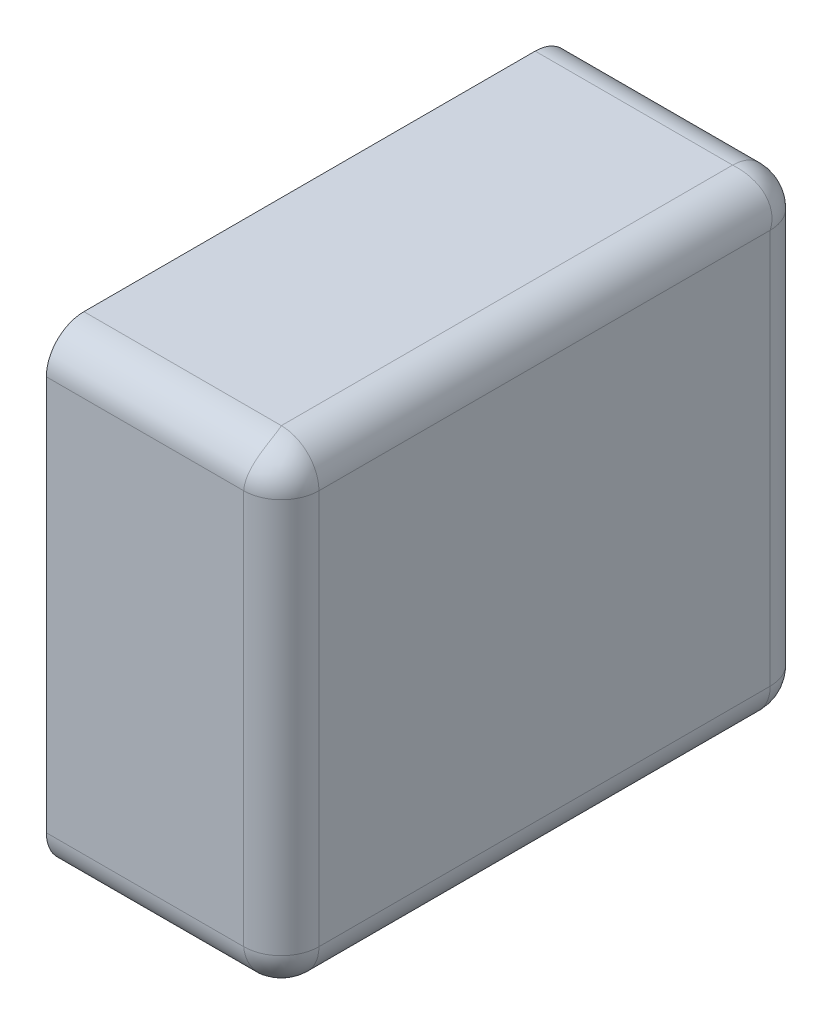
ISO-10303-21;
HEADER;
FILE_DESCRIPTION(('STEP AP214'),'2;1');
FILE_NAME('part.step','',(''),(''),'','','');
FILE_SCHEMA(('AUTOMOTIVE_DESIGN { 1 0 10303 214 1 1 1 1 }'));
ENDSEC;
DATA;
#1=APPLICATION_CONTEXT('core data for automotive mechanical design processes');
#2=APPLICATION_PROTOCOL_DEFINITION('international standard','automotive_design',2000,#1);
#3=PRODUCT_CONTEXT('',#1,'mechanical');
#4=PRODUCT('Part','Part','',(#3));
#5=PRODUCT_RELATED_PRODUCT_CATEGORY('part','',(#4));
#6=PRODUCT_DEFINITION_FORMATION('','',#4);
#7=PRODUCT_DEFINITION_CONTEXT('part definition',#1,'design');
#8=PRODUCT_DEFINITION('design','',#6,#7);
#9=PRODUCT_DEFINITION_SHAPE('','',#8);
#10=(LENGTH_UNIT() NAMED_UNIT(*) SI_UNIT(.MILLI.,.METRE.));
#11=(NAMED_UNIT(*) PLANE_ANGLE_UNIT() SI_UNIT($,.RADIAN.));
#12=(NAMED_UNIT(*) SI_UNIT($,.STERADIAN.) SOLID_ANGLE_UNIT());
#13=UNCERTAINTY_MEASURE_WITH_UNIT(LENGTH_MEASURE(1.E-05),#10,'distance_accuracy_value','');
#14=(GEOMETRIC_REPRESENTATION_CONTEXT(3) GLOBAL_UNCERTAINTY_ASSIGNED_CONTEXT((#13)) GLOBAL_UNIT_ASSIGNED_CONTEXT((#10,
#11,#12)) REPRESENTATION_CONTEXT('',''));
#15=CARTESIAN_POINT('',(0.,0.,0.));
#16=DIRECTION('',(0.,0.,1.));
#17=DIRECTION('',(1.,0.,0.));
#18=AXIS2_PLACEMENT_3D('',#15,#16,#17);
#19=CARTESIAN_POINT('',(0.46,-0.21,0.52));
#20=DIRECTION('',(-0.408248290463862,-0.816496580927726,-0.408248290463864));
#21=DIRECTION('',(0.577350269189625,-0.577350269189626,0.577350269189627));
#22=AXIS2_PLACEMENT_3D('',#19,#20,#21);
#23=SPHERICAL_SURFACE('',#22,0.04);
#24=CARTESIAN_POINT('',(0.46,-0.21,0.56));
#25=CARTESIAN_POINT('',(0.460045181312705,-0.210665081942134,0.560000016251174));
#26=CARTESIAN_POINT('',(0.460096934649245,-0.211329688899863,0.559983337054039));
#27=CARTESIAN_POINT('',(0.460212312956499,-0.212659219399001,0.55991655645203));
#28=CARTESIAN_POINT('',(0.460275990401151,-0.213324130857231,0.559866304694446));
#29=CARTESIAN_POINT('',(0.460413787737315,-0.214652188884861,0.559732078063409));
#30=CARTESIAN_POINT('',(0.460487948826669,-0.215315317435962,0.559647967602046));
#31=CARTESIAN_POINT('',(0.460645216653365,-0.21663777331629,0.559445897918684));
#32=CARTESIAN_POINT('',(0.4607283543202,-0.217297078685777,0.559327819170727));
#33=CARTESIAN_POINT('',(0.46090202300229,-0.218609877799322,0.559057833913879));
#34=CARTESIAN_POINT('',(0.460992575894087,-0.21926334754146,0.558905824846854));
#35=CARTESIAN_POINT('',(0.461179475341301,-0.220562505613394,0.558568156224819));
#36=CARTESIAN_POINT('',(0.461275836098283,-0.221208169816909,0.558382411747495));
#37=CARTESIAN_POINT('',(0.46147271375646,-0.222489792933958,0.557977604210201));
#38=CARTESIAN_POINT('',(0.46157323870074,-0.223125729474544,0.557758474251228));
#39=CARTESIAN_POINT('',(0.46177677883926,-0.22438602682711,0.557287382721173));
#40=CARTESIAN_POINT('',(0.461879797543165,-0.225010368841736,0.557035372388784));
#41=CARTESIAN_POINT('',(0.462086640648683,-0.226245666734241,0.556499161053504));
#42=CARTESIAN_POINT('',(0.462190465730978,-0.226856609134299,0.55621492926737));
#43=CARTESIAN_POINT('',(0.46239722819872,-0.228063363889427,0.555615068285972));
#44=CARTESIAN_POINT('',(0.46250016518995,-0.228659169732883,0.555299425855903));
#45=CARTESIAN_POINT('',(0.462703459130378,-0.229833980057633,0.554637686703484));
#46=CARTESIAN_POINT('',(0.462803816384422,-0.23041298652516,0.554291593601069));
#47=CARTESIAN_POINT('',(0.463000269462519,-0.231552605119571,0.553570042877811));
#48=CARTESIAN_POINT('',(0.463096368054564,-0.232113229130937,0.553194604782275));
#49=CARTESIAN_POINT('',(0.463282643251913,-0.233214573536402,0.552415596564543));
#50=CARTESIAN_POINT('',(0.463372826812942,-0.233755316967508,0.552012060678785));
#51=CARTESIAN_POINT('',(0.46354564201038,-0.234815479598414,0.551178227431671));
#52=CARTESIAN_POINT('',(0.463628286445982,-0.235334934082229,0.550747977592035));
#53=CARTESIAN_POINT('',(0.463784433723584,-0.236351191404029,0.549862219687463));
#54=CARTESIAN_POINT('',(0.463857956766166,-0.236848042695183,0.549406770787941));
#55=CARTESIAN_POINT('',(0.463994321319257,-0.237817863512161,0.548472244674781));
#56=CARTESIAN_POINT('',(0.46405719186342,-0.23829089539864,0.547993236431504));
#57=CARTESIAN_POINT('',(0.464170770435167,-0.239211948220121,0.547013341512198));
#58=CARTESIAN_POINT('',(0.464221517607221,-0.239660045967351,0.546512531597073));
#59=CARTESIAN_POINT('',(0.464309436340763,-0.240530205425421,0.545490895871217));
#60=CARTESIAN_POINT('',(0.464346658254607,-0.240952358740541,0.544970152446474));
#61=CARTESIAN_POINT('',(0.464406189870943,-0.241769711036923,0.543910616989062));
#62=CARTESIAN_POINT('',(0.4644285620246,-0.242165016543171,0.543371910678868));
#63=CARTESIAN_POINT('',(0.464457142234807,-0.242927863908271,0.542278513023084));
#64=CARTESIAN_POINT('',(0.464463425502259,-0.243295527122686,0.541723908356188));
#65=CARTESIAN_POINT('',(0.464458668570609,-0.244002391272381,0.540600864869804));
#66=CARTESIAN_POINT('',(0.464447716751283,-0.244341728079411,0.540032511248382));
#67=CARTESIAN_POINT('',(0.46440743011501,-0.244991352668484,0.538884198547395));
#68=CARTESIAN_POINT('',(0.464378196984959,-0.245301790296003,0.538304320731066));
#69=CARTESIAN_POINT('',(0.464300394897465,-0.245893142340814,0.537135256366021));
#70=CARTESIAN_POINT('',(0.464251940785221,-0.246174219805183,0.53654614471619));
#71=CARTESIAN_POINT('',(0.464134856746394,-0.246706490168637,0.535360966678358));
#72=CARTESIAN_POINT('',(0.464066354376574,-0.246957858314749,0.534764966470295));
#73=CARTESIAN_POINT('',(0.46390845289006,-0.247430460923945,0.533568413630763));
#74=CARTESIAN_POINT('',(0.463819193285901,-0.247651881608702,0.53296791621749));
#75=CARTESIAN_POINT('',(0.463619178639514,-0.248064452661553,0.531764802341561));
#76=CARTESIAN_POINT('',(0.463508574015279,-0.24825579877532,0.531162228110556));
#77=CARTESIAN_POINT('',(0.463265404318733,-0.248608191353398,0.529957437108347));
#78=CARTESIAN_POINT('',(0.463132999169867,-0.248769441456167,0.529355247629956));
#79=CARTESIAN_POINT('',(0.462845874981088,-0.249061732555454,0.528153648342018));
#80=CARTESIAN_POINT('',(0.462691323865077,-0.249192983158802,0.527554249833818));
#81=CARTESIAN_POINT('',(0.462442185895687,-0.249367646988296,0.526657556406001));
#82=CARTESIAN_POINT('',(0.462356511105421,-0.249422048123955,0.526359866083455));
#83=CARTESIAN_POINT('',(0.462179544933358,-0.24952340711272,0.525766109942693));
#84=CARTESIAN_POINT('',(0.462088275552899,-0.249570391814223,0.525470042193562));
#85=CARTESIAN_POINT('',(0.461900119585062,-0.249656954688614,0.524879850156528));
#86=CARTESIAN_POINT('',(0.461803255191422,-0.249696559802491,0.524585722737492));
#87=CARTESIAN_POINT('',(0.461603913603208,-0.249768410388877,0.523999713457951));
#88=CARTESIAN_POINT('',(0.461501458734764,-0.249800682809452,0.523707827313347));
#89=CARTESIAN_POINT('',(0.461290950148552,-0.249857919916979,0.523126605044557));
#90=CARTESIAN_POINT('',(0.461182918810225,-0.249882911490818,0.5228372634657));
#91=CARTESIAN_POINT('',(0.460961279831825,-0.2499256451994,0.522261431714088));
#92=CARTESIAN_POINT('',(0.460847694547059,-0.249943414085128,0.521974934925471));
#93=CARTESIAN_POINT('',(0.460614978217461,-0.249971766016728,0.521405091561275));
#94=CARTESIAN_POINT('',(0.460495869427172,-0.249982375605942,0.521121737223217));
#95=CARTESIAN_POINT('',(0.460252147979106,-0.249996480060414,0.520558476265733));
#96=CARTESIAN_POINT('',(0.460127557385056,-0.250000001180721,0.520278560754346));
#97=CARTESIAN_POINT('',(0.46,-0.25,0.52));
#98=B_SPLINE_CURVE_WITH_KNOTS('',3,(#24,#25,#26,#27,#28,#29,#30,#31,#32,#33,#34,#35,#36,#37,#38,
#39,#40,#41,#42,#43,#44,#45,#46,#47,#48,#49,#50,#51,#52,#53,#54,#55,#56,#57,#58,#59,#60,#61,#62,
#63,#64,#65,#66,#67,#68,#69,#70,#71,#72,#73,#74,#75,#76,#77,#78,#79,#80,#81,#82,#83,#84,#85,#86,
#87,#88,#89,#90,#91,#92,#93,#94,#95,#96,#97),.UNSPECIFIED.,.F.,.F.,(4,2,2,2,2,2,2,2,2,2,2,2,2,2,
2,2,2,2,2,2,2,2,2,2,2,2,2,2,2,2,2,2,2,2,2,2,4),(0.,0.00199956279863084,0.0040081410898894,
0.0060248440879793,0.00804873202897933,0.010078822288103,0.0121140955766896,0.0141535022022144,
0.0161959683770328,0.0182404025635261,0.0202857018448312,0.0223307583114294,0.0243744654545608,
0.0264157245577323,0.0284534510775014,0.0304865810042484,0.0325140771927836,0.0345349356513621,
0.036548191775973,0.0385529265146135,0.0405482724436222,0.0425334197350034,0.0445076219900069,
0.0464702019100226,0.0484205567711027,0.0503581636631714,0.0522825844492586,0.0541934703940113,
0.0560905664044141,0.0570339941541347,0.0579739241186476,0.0589103523629721,0.0598432814165442,
0.0607727203414586,0.0616986847895223,0.0626211970474673,0.0635402860696658),.UNSPECIFIED.);
#99=CARTESIAN_POINT('',(0.46,-0.21,0.56));
#100=VERTEX_POINT('',#99);
#101=CARTESIAN_POINT('',(0.46,-0.25,0.52));
#102=VERTEX_POINT('',#101);
#103=EDGE_CURVE('E11',#100,#102,#98,.T.);
#104=ORIENTED_EDGE('',*,*,#103,.T.);
#105=CARTESIAN_POINT('',(0.46,-0.21,0.52));
#106=DIRECTION('',(0.,0.,1.));
#107=DIRECTION('',(1.,0.,0.));
#108=AXIS2_PLACEMENT_3D('',#105,#106,#107);
#109=CIRCLE('',#108,0.04);
#110=CARTESIAN_POINT('',(0.5,-0.21,0.52));
#111=VERTEX_POINT('',#110);
#112=EDGE_CURVE('E25',#102,#111,#109,.T.);
#113=ORIENTED_EDGE('',*,*,#112,.T.);
#114=CARTESIAN_POINT('',(0.46,-0.21,0.52));
#115=DIRECTION('',(0.,-1.,0.));
#116=DIRECTION('',(0.,0.,1.));
#117=AXIS2_PLACEMENT_3D('',#114,#115,#116);
#118=CIRCLE('',#117,0.04);
#119=EDGE_CURVE('E317',#111,#100,#118,.T.);
#120=ORIENTED_EDGE('',*,*,#119,.T.);
#121=EDGE_LOOP('',(#104,#113,#120));
#122=FACE_BOUND('',#121,.T.);
#123=ADVANCED_FACE('F17',(#122),#23,.T.);
#124=CARTESIAN_POINT('',(0.46,-0.21,0.04));
#125=DIRECTION('',(-0.408248290463863,0.408248290463862,-0.816496580927727));
#126=DIRECTION('',(0.577350269189628,-0.577350269189625,-0.577350269189625));
#127=AXIS2_PLACEMENT_3D('',#124,#125,#126);
#128=SPHERICAL_SURFACE('',#127,0.04);
#129=CARTESIAN_POINT('',(0.46,-0.21,0.04));
#130=DIRECTION('',(0.,0.,-1.));
#131=DIRECTION('',(0.,-1.,0.));
#132=AXIS2_PLACEMENT_3D('',#129,#130,#131);
#133=CIRCLE('',#132,0.04);
#134=CARTESIAN_POINT('',(0.5,-0.21,0.04));
#135=VERTEX_POINT('',#134);
#136=CARTESIAN_POINT('',(0.46,-0.25,0.04));
#137=VERTEX_POINT('',#136);
#138=EDGE_CURVE('E315',#135,#137,#133,.T.);
#139=ORIENTED_EDGE('',*,*,#138,.T.);
#140=CARTESIAN_POINT('',(0.46,-0.25,0.04));
#141=CARTESIAN_POINT('',(0.460045181312705,-0.250000016251174,0.0393349180578663));
#142=CARTESIAN_POINT('',(0.460096934649245,-0.249983337054039,0.0386703111001374));
#143=CARTESIAN_POINT('',(0.460212312956498,-0.24991655645203,0.0373407806009987));
#144=CARTESIAN_POINT('',(0.460275990401151,-0.249866304694446,0.0366758691427694));
#145=CARTESIAN_POINT('',(0.460413787737315,-0.249732078063409,0.0353478111151388));
#146=CARTESIAN_POINT('',(0.460487948826669,-0.249647967602046,0.0346846825640378));
#147=CARTESIAN_POINT('',(0.460645216653365,-0.249445897918684,0.03336222668371));
#148=CARTESIAN_POINT('',(0.4607283543202,-0.249327819170727,0.0327029213142236));
#149=CARTESIAN_POINT('',(0.46090202300229,-0.249057833913879,0.0313901222006782));
#150=CARTESIAN_POINT('',(0.460992575894087,-0.248905824846854,0.0307366524585404));
#151=CARTESIAN_POINT('',(0.461179475341301,-0.248568156224819,0.029437494386606));
#152=CARTESIAN_POINT('',(0.461275836098283,-0.248382411747495,0.0287918301830908));
#153=CARTESIAN_POINT('',(0.46147271375646,-0.247977604210201,0.0275102070660422));
#154=CARTESIAN_POINT('',(0.46157323870074,-0.247758474251228,0.0268742705254564));
#155=CARTESIAN_POINT('',(0.46177677883926,-0.247287382721173,0.0256139731728899));
#156=CARTESIAN_POINT('',(0.461879797543165,-0.247035372388784,0.0249896311582642));
#157=CARTESIAN_POINT('',(0.462086640648683,-0.246499161053504,0.0237543332657589));
#158=CARTESIAN_POINT('',(0.462190465730978,-0.24621492926737,0.0231433908657014));
#159=CARTESIAN_POINT('',(0.462397228198719,-0.245615068285972,0.0219366361105733));
#160=CARTESIAN_POINT('',(0.46250016518995,-0.245299425855903,0.0213408302671167));
#161=CARTESIAN_POINT('',(0.462703459130378,-0.244637686703484,0.020166019942367));
#162=CARTESIAN_POINT('',(0.462803816384422,-0.244291593601069,0.0195870134748399));
#163=CARTESIAN_POINT('',(0.463000269462519,-0.243570042877811,0.0184473948804289));
#164=CARTESIAN_POINT('',(0.463096368054564,-0.243194604782275,0.0178867708690628));
#165=CARTESIAN_POINT('',(0.463282643251913,-0.242415596564543,0.0167854264635976));
#166=CARTESIAN_POINT('',(0.463372826812942,-0.242012060678785,0.0162446830324919));
#167=CARTESIAN_POINT('',(0.46354564201038,-0.241178227431671,0.0151845204015858));
#168=CARTESIAN_POINT('',(0.463628286445982,-0.240747977592035,0.0146650659177713));
#169=CARTESIAN_POINT('',(0.463784433723584,-0.239862219687463,0.013648808595971));
#170=CARTESIAN_POINT('',(0.463857956766166,-0.239406770787941,0.013151957304817));
#171=CARTESIAN_POINT('',(0.463994321319257,-0.238472244674781,0.0121821364878388));
#172=CARTESIAN_POINT('',(0.46405719186342,-0.237993236431504,0.0117091046013598));
#173=CARTESIAN_POINT('',(0.464170770435167,-0.237013341512198,0.010788051779879));
#174=CARTESIAN_POINT('',(0.464221517607221,-0.236512531597073,0.0103399540326488));
#175=CARTESIAN_POINT('',(0.464309436340763,-0.235490895871217,0.00946979457457914));
#176=CARTESIAN_POINT('',(0.464346658254607,-0.234970152446474,0.009047641259459));
#177=CARTESIAN_POINT('',(0.464406189870943,-0.233910616989061,0.00823028896307656));
#178=CARTESIAN_POINT('',(0.4644285620246,-0.233371910678868,0.0078349834568294));
#179=CARTESIAN_POINT('',(0.464457142234807,-0.232278513023084,0.0070721360917289));
#180=CARTESIAN_POINT('',(0.464463425502259,-0.231723908356188,0.00670447287731431));
#181=CARTESIAN_POINT('',(0.464458668570609,-0.230600864869804,0.00599760872761896));
#182=CARTESIAN_POINT('',(0.464447716751283,-0.230032511248382,0.00565827192058937));
#183=CARTESIAN_POINT('',(0.46440743011501,-0.228884198547395,0.0050086473315155));
#184=CARTESIAN_POINT('',(0.464378196984959,-0.228304320731066,0.00469820970399707));
#185=CARTESIAN_POINT('',(0.464300394897465,-0.227135256366021,0.00410685765918635));
#186=CARTESIAN_POINT('',(0.464251940785221,-0.22654614471619,0.00382578019481727));
#187=CARTESIAN_POINT('',(0.464134856746394,-0.225360966678358,0.00329350983136255));
#188=CARTESIAN_POINT('',(0.464066354376574,-0.224764966470295,0.00304214168525152));
#189=CARTESIAN_POINT('',(0.46390845289006,-0.223568413630763,0.0025695390760552));
#190=CARTESIAN_POINT('',(0.463819193285901,-0.22296791621749,0.00234811839129834));
#191=CARTESIAN_POINT('',(0.463619178639514,-0.221764802341561,0.00193554733844656));
#192=CARTESIAN_POINT('',(0.463508574015279,-0.221162228110556,0.00174420122467977));
#193=CARTESIAN_POINT('',(0.463265404318734,-0.219957437108347,0.00139180864660246));
#194=CARTESIAN_POINT('',(0.463132999169867,-0.219355247629956,0.00123055854383292));
#195=CARTESIAN_POINT('',(0.462845874981088,-0.218153648342018,0.000938267444546416));
#196=CARTESIAN_POINT('',(0.462691323865077,-0.217554249833819,0.000807016841198092));
#197=CARTESIAN_POINT('',(0.462442185895688,-0.216657556406001,0.000632353011704253));
#198=CARTESIAN_POINT('',(0.462356511105422,-0.216359866083455,0.000577951876045363));
#199=CARTESIAN_POINT('',(0.462179544933358,-0.215766109942693,0.00047659288727976));
#200=CARTESIAN_POINT('',(0.462088275552899,-0.215470042193562,0.000429608185776681));
#201=CARTESIAN_POINT('',(0.461900119585062,-0.214879850156529,0.000343045311385648));
#202=CARTESIAN_POINT('',(0.461803255191423,-0.214585722737492,0.000303440197509093));
#203=CARTESIAN_POINT('',(0.461603913603209,-0.213999713457951,0.000231589611122885));
#204=CARTESIAN_POINT('',(0.461501458734764,-0.213707827313347,0.00019931719054796));
#205=CARTESIAN_POINT('',(0.461290950148552,-0.213126605044557,0.000142080083021138));
#206=CARTESIAN_POINT('',(0.461182918810225,-0.2128372634657,0.000117088509181835));
#207=CARTESIAN_POINT('',(0.460961279831825,-0.212261431714088,7.43548005994835E-05));
#208=CARTESIAN_POINT('',(0.460847694547059,-0.211974934925471,5.65859148722095E-05));
#209=CARTESIAN_POINT('',(0.460614978217461,-0.211405091561275,2.82339832723494E-05));
#210=CARTESIAN_POINT('',(0.460495869427172,-0.211121737223217,1.76243940577182E-05));
#211=CARTESIAN_POINT('',(0.460252147979106,-0.210558476265733,3.5199395857389E-06));
#212=CARTESIAN_POINT('',(0.460127557385056,-0.210278560754346,-1.18072139678394E-09));
#213=CARTESIAN_POINT('',(0.46,-0.21,0.));
#214=B_SPLINE_CURVE_WITH_KNOTS('',3,(#140,#141,#142,#143,#144,#145,#146,#147,#148,#149,#150,
#151,#152,#153,#154,#155,#156,#157,#158,#159,#160,#161,#162,#163,#164,#165,#166,#167,#168,#169,
#170,#171,#172,#173,#174,#175,#176,#177,#178,#179,#180,#181,#182,#183,#184,#185,#186,#187,#188,
#189,#190,#191,#192,#193,#194,#195,#196,#197,#198,#199,#200,#201,#202,#203,#204,#205,#206,#207,
#208,#209,#210,#211,#212,#213),.UNSPECIFIED.,.F.,.F.,(4,2,2,2,2,2,2,2,2,2,2,2,2,2,2,2,2,2,2,2,2,
2,2,2,2,2,2,2,2,2,2,2,2,2,2,2,4),(0.,0.00199956279863086,0.0040081410898894,0.00602484408797931,
0.00804873202897934,0.0100788222881031,0.0121140955766896,0.0141535022022144,0.0161959683770328,
0.0182404025635261,0.0202857018448312,0.0223307583114294,0.0243744654545608,0.0264157245577324,
0.0284534510775015,0.0304865810042485,0.0325140771927837,0.0345349356513622,0.0365481917759731,
0.0385529265146136,0.0405482724436223,0.0425334197350035,0.044507621990007,0.0464702019100227,
0.0484205567711029,0.0503581636631715,0.0522825844492588,0.0541934703940115,0.0560905664044142,
0.0570339941541349,0.0579739241186477,0.0589103523629722,0.0598432814165443,0.0607727203414588,
0.0616986847895225,0.0626211970474674,0.063540286069666),.UNSPECIFIED.);
#215=CARTESIAN_POINT('',(0.46,-0.21,0.));
#216=VERTEX_POINT('',#215);
#217=EDGE_CURVE('E284',#137,#216,#214,.T.);
#218=ORIENTED_EDGE('',*,*,#217,.T.);
#219=CARTESIAN_POINT('',(0.46,-0.21,0.04));
#220=DIRECTION('',(0.,-1.,0.));
#221=DIRECTION('',(1.,0.,0.));
#222=AXIS2_PLACEMENT_3D('',#219,#220,#221);
#223=CIRCLE('',#222,0.04);
#224=EDGE_CURVE('E279',#216,#135,#223,.T.);
#225=ORIENTED_EDGE('',*,*,#224,.T.);
#226=EDGE_LOOP('',(#139,#218,#225));
#227=FACE_BOUND('',#226,.T.);
#228=ADVANCED_FACE('F298',(#227),#128,.T.);
#229=CARTESIAN_POINT('',(0.3125,-0.21,0.04));
#230=DIRECTION('',(1.,0.,0.));
#231=DIRECTION('',(0.,-0.707106781186548,-0.707106781186547));
#232=AXIS2_PLACEMENT_3D('',#229,#230,#231);
#233=CYLINDRICAL_SURFACE('',#232,0.04);
#234=CARTESIAN_POINT('',(0.250000000000001,-0.21,0.04));
#235=DIRECTION('',(1.,0.,0.));
#236=DIRECTION('',(0.,-0.707106781186548,-0.707106781186547));
#237=AXIS2_PLACEMENT_3D('',#234,#235,#236);
#238=CIRCLE('',#237,0.04);
#239=CARTESIAN_POINT('',(0.25,-0.25,0.04));
#240=VERTEX_POINT('',#239);
#241=CARTESIAN_POINT('',(0.25,-0.21,0.));
#242=VERTEX_POINT('',#241);
#243=EDGE_CURVE('E277',#240,#242,#238,.T.);
#244=ORIENTED_EDGE('',*,*,#243,.T.);
#245=DIRECTION('',(1.,0.,0.));
#246=VECTOR('',#245,1.);
#247=CARTESIAN_POINT('',(0.3125,-0.21,0.));
#248=LINE('',#247,#246);
#249=EDGE_CURVE('E272',#242,#216,#248,.T.);
#250=ORIENTED_EDGE('',*,*,#249,.T.);
#251=ORIENTED_EDGE('',*,*,#217,.F.);
#252=DIRECTION('',(-1.,0.,0.));
#253=VECTOR('',#252,1.);
#254=CARTESIAN_POINT('',(0.3125,-0.25,0.04));
#255=LINE('',#254,#253);
#256=EDGE_CURVE('E267',#137,#240,#255,.T.);
#257=ORIENTED_EDGE('',*,*,#256,.T.);
#258=EDGE_LOOP('',(#244,#250,#251,#257));
#259=FACE_BOUND('',#258,.T.);
#260=ADVANCED_FACE('F290',(#259),#233,.T.);
#261=CARTESIAN_POINT('',(0.46,0.21,0.52));
#262=DIRECTION('',(0.408248290463863,-0.816496580927726,0.408248290463864));
#263=DIRECTION('',(0.577350269189626,0.577350269189626,0.577350269189625));
#264=AXIS2_PLACEMENT_3D('',#261,#262,#263);
#265=SPHERICAL_SURFACE('',#264,0.04);
#266=CARTESIAN_POINT('',(0.46,0.21,0.52));
#267=DIRECTION('',(0.,1.,0.));
#268=DIRECTION('',(1.,0.,0.));
#269=AXIS2_PLACEMENT_3D('',#266,#267,#268);
#270=CIRCLE('',#269,0.04);
#271=CARTESIAN_POINT('',(0.46,0.21,0.56));
#272=VERTEX_POINT('',#271);
#273=CARTESIAN_POINT('',(0.5,0.21,0.52));
#274=VERTEX_POINT('',#273);
#275=EDGE_CURVE('E263',#272,#274,#270,.T.);
#276=ORIENTED_EDGE('',*,*,#275,.T.);
#277=CARTESIAN_POINT('',(0.46,0.21,0.52));
#278=DIRECTION('',(0.,0.,1.));
#279=DIRECTION('',(0.,1.,0.));
#280=AXIS2_PLACEMENT_3D('',#277,#278,#279);
#281=CIRCLE('',#280,0.04);
#282=CARTESIAN_POINT('',(0.46,0.25,0.52));
#283=VERTEX_POINT('',#282);
#284=EDGE_CURVE('E261',#274,#283,#281,.T.);
#285=ORIENTED_EDGE('',*,*,#284,.T.);
#286=CARTESIAN_POINT('',(0.46,0.25,0.52));
#287=CARTESIAN_POINT('',(0.460127557385056,0.250000001180721,0.520278560754346));
#288=CARTESIAN_POINT('',(0.460252147979106,0.249996480060414,0.520558476265733));
#289=CARTESIAN_POINT('',(0.460495869427172,0.249982375605942,0.521121737223217));
#290=CARTESIAN_POINT('',(0.460614978217461,0.249971766016728,0.521405091561275));
#291=CARTESIAN_POINT('',(0.460847694547059,0.249943414085128,0.521974934925471));
#292=CARTESIAN_POINT('',(0.460961279831825,0.249925645199401,0.522261431714088));
#293=CARTESIAN_POINT('',(0.461182918810225,0.249882911490818,0.5228372634657));
#294=CARTESIAN_POINT('',(0.461290950148552,0.249857919916979,0.523126605044557));
#295=CARTESIAN_POINT('',(0.461501458734764,0.249800682809452,0.523707827313347));
#296=CARTESIAN_POINT('',(0.461603913603208,0.249768410388877,0.523999713457951));
#297=CARTESIAN_POINT('',(0.461803255191422,0.249696559802491,0.524585722737492));
#298=CARTESIAN_POINT('',(0.461900119585062,0.249656954688614,0.524879850156528));
#299=CARTESIAN_POINT('',(0.462088275552899,0.249570391814223,0.525470042193562));
#300=CARTESIAN_POINT('',(0.462179544933358,0.24952340711272,0.525766109942693));
#301=CARTESIAN_POINT('',(0.462356511105421,0.249422048123955,0.526359866083455));
#302=CARTESIAN_POINT('',(0.462442185895687,0.249367646988296,0.526657556406001));
#303=CARTESIAN_POINT('',(0.462691323865077,0.249192983158802,0.527554249833818));
#304=CARTESIAN_POINT('',(0.462845874981088,0.249061732555454,0.528153648342018));
#305=CARTESIAN_POINT('',(0.463132999169867,0.248769441456167,0.529355247629956));
#306=CARTESIAN_POINT('',(0.463265404318734,0.248608191353398,0.529957437108347));
#307=CARTESIAN_POINT('',(0.463508574015279,0.24825579877532,0.531162228110556));
#308=CARTESIAN_POINT('',(0.463619178639514,0.248064452661553,0.531764802341561));
#309=CARTESIAN_POINT('',(0.463819193285901,0.247651881608702,0.53296791621749));
#310=CARTESIAN_POINT('',(0.46390845289006,0.247430460923945,0.533568413630763));
#311=CARTESIAN_POINT('',(0.464066354376574,0.246957858314749,0.534764966470295));
#312=CARTESIAN_POINT('',(0.464134856746394,0.246706490168638,0.535360966678358));
#313=CARTESIAN_POINT('',(0.464251940785221,0.246174219805183,0.53654614471619));
#314=CARTESIAN_POINT('',(0.464300394897465,0.245893142340814,0.537135256366021));
#315=CARTESIAN_POINT('',(0.464378196984959,0.245301790296003,0.538304320731066));
#316=CARTESIAN_POINT('',(0.46440743011501,0.244991352668485,0.538884198547395));
#317=CARTESIAN_POINT('',(0.464447716751283,0.244341728079411,0.540032511248382));
#318=CARTESIAN_POINT('',(0.464458668570609,0.244002391272381,0.540600864869804));
#319=CARTESIAN_POINT('',(0.464463425502259,0.243295527122686,0.541723908356188));
#320=CARTESIAN_POINT('',(0.464457142234807,0.242927863908271,0.542278513023084));
#321=CARTESIAN_POINT('',(0.4644285620246,0.242165016543171,0.543371910678868));
#322=CARTESIAN_POINT('',(0.464406189870943,0.241769711036923,0.543910616989062));
#323=CARTESIAN_POINT('',(0.464346658254607,0.240952358740541,0.544970152446474));
#324=CARTESIAN_POINT('',(0.464309436340763,0.240530205425421,0.545490895871217));
#325=CARTESIAN_POINT('',(0.464221517607221,0.239660045967351,0.546512531597073));
#326=CARTESIAN_POINT('',(0.464170770435167,0.239211948220121,0.547013341512198));
#327=CARTESIAN_POINT('',(0.46405719186342,0.23829089539864,0.547993236431504));
#328=CARTESIAN_POINT('',(0.463994321319257,0.237817863512161,0.548472244674781));
#329=CARTESIAN_POINT('',(0.463857956766166,0.236848042695183,0.549406770787941));
#330=CARTESIAN_POINT('',(0.463784433723584,0.236351191404029,0.549862219687463));
#331=CARTESIAN_POINT('',(0.463628286445982,0.235334934082229,0.550747977592035));
#332=CARTESIAN_POINT('',(0.46354564201038,0.234815479598414,0.551178227431671));
#333=CARTESIAN_POINT('',(0.463372826812942,0.233755316967508,0.552012060678785));
#334=CARTESIAN_POINT('',(0.463282643251913,0.233214573536402,0.552415596564544));
#335=CARTESIAN_POINT('',(0.463096368054564,0.232113229130937,0.553194604782275));
#336=CARTESIAN_POINT('',(0.463000269462519,0.231552605119571,0.553570042877811));
#337=CARTESIAN_POINT('',(0.462803816384422,0.23041298652516,0.554291593601069));
#338=CARTESIAN_POINT('',(0.462703459130377,0.229833980057633,0.554637686703484));
#339=CARTESIAN_POINT('',(0.46250016518995,0.228659169732883,0.555299425855903));
#340=CARTESIAN_POINT('',(0.462397228198719,0.228063363889427,0.555615068285972));
#341=CARTESIAN_POINT('',(0.462190465730978,0.226856609134299,0.55621492926737));
#342=CARTESIAN_POINT('',(0.462086640648683,0.226245666734241,0.556499161053504));
#343=CARTESIAN_POINT('',(0.461879797543165,0.225010368841736,0.557035372388784));
#344=CARTESIAN_POINT('',(0.46177677883926,0.22438602682711,0.557287382721173));
#345=CARTESIAN_POINT('',(0.46157323870074,0.223125729474544,0.557758474251228));
#346=CARTESIAN_POINT('',(0.46147271375646,0.222489792933958,0.557977604210201));
#347=CARTESIAN_POINT('',(0.461275836098283,0.221208169816909,0.558382411747495));
#348=CARTESIAN_POINT('',(0.461179475341301,0.220562505613394,0.558568156224819));
#349=CARTESIAN_POINT('',(0.460992575894087,0.21926334754146,0.558905824846854));
#350=CARTESIAN_POINT('',(0.46090202300229,0.218609877799322,0.559057833913879));
#351=CARTESIAN_POINT('',(0.4607283543202,0.217297078685776,0.559327819170727));
#352=CARTESIAN_POINT('',(0.460645216653365,0.21663777331629,0.559445897918684));
#353=CARTESIAN_POINT('',(0.460487948826669,0.215315317435962,0.559647967602046));
#354=CARTESIAN_POINT('',(0.460413787737315,0.214652188884861,0.559732078063409));
#355=CARTESIAN_POINT('',(0.460275990401151,0.213324130857231,0.559866304694446));
#356=CARTESIAN_POINT('',(0.460212312956498,0.212659219399001,0.55991655645203));
#357=CARTESIAN_POINT('',(0.460096934649245,0.211329688899863,0.559983337054039));
#358=CARTESIAN_POINT('',(0.460045181312705,0.210665081942134,0.560000016251174));
#359=CARTESIAN_POINT('',(0.46,0.21,0.56));
#360=B_SPLINE_CURVE_WITH_KNOTS('',3,(#286,#287,#288,#289,#290,#291,#292,#293,#294,#295,#296,
#297,#298,#299,#300,#301,#302,#303,#304,#305,#306,#307,#308,#309,#310,#311,#312,#313,#314,#315,
#316,#317,#318,#319,#320,#321,#322,#323,#324,#325,#326,#327,#328,#329,#330,#331,#332,#333,#334,
#335,#336,#337,#338,#339,#340,#341,#342,#343,#344,#345,#346,#347,#348,#349,#350,#351,#352,#353,
#354,#355,#356,#357,#358,#359),.UNSPECIFIED.,.F.,.F.,(4,2,2,2,2,2,2,2,2,2,2,2,2,2,2,2,2,2,2,2,2,
2,2,2,2,2,2,2,2,2,2,2,2,2,2,2,4),(0.,0.0009190890221986,0.00184160128014347,0.00276756572820719,
0.00369700465312164,0.00462993370669375,0.00556636195101832,0.00650629191553119,
0.00744971966525185,0.0093468156756546,0.0112577016204073,0.0131821224064946,0.0151197292985631,
0.0170700841596432,0.0190326640796589,0.0210068663346626,0.0229920136260437,0.0249873595550524,
0.0269920942936929,0.0290053504183038,0.0310262088768824,0.0330537050654176,0.0350868349921645,
0.0371245615119337,0.0391658206151053,0.0412095277582366,0.0432545842248347,0.0452998835061399,
0.0473443176926332,0.0493867838674517,0.0514261904929764,0.053461463781563,0.0554915540406867,
0.0575154419816867,0.0595321449797766,0.0615407232710351,0.063540286069666),.UNSPECIFIED.);
#361=EDGE_CURVE('E248',#283,#272,#360,.T.);
#362=ORIENTED_EDGE('',*,*,#361,.T.);
#363=EDGE_LOOP('',(#276,#285,#362));
#364=FACE_BOUND('',#363,.T.);
#365=ADVANCED_FACE('F222',(#364),#265,.T.);
#366=CARTESIAN_POINT('',(0.46,0.21,0.04));
#367=DIRECTION('',(-0.816496580927726,0.408248290463863,-0.408248290463863));
#368=DIRECTION('',(0.577350269189626,0.577350269189626,-0.577350269189626));
#369=AXIS2_PLACEMENT_3D('',#366,#367,#368);
#370=SPHERICAL_SURFACE('',#369,0.04);
#371=CARTESIAN_POINT('',(0.46,0.25,0.04));
#372=CARTESIAN_POINT('',(0.460665081942134,0.250000016251174,0.0399548186872946));
#373=CARTESIAN_POINT('',(0.461329688899863,0.249983337054039,0.0399030653507546));
#374=CARTESIAN_POINT('',(0.462659219399001,0.24991655645203,0.0397876870435016));
#375=CARTESIAN_POINT('',(0.463324130857231,0.249866304694446,0.0397240095988487));
#376=CARTESIAN_POINT('',(0.464652188884861,0.249732078063409,0.0395862122626852));
#377=CARTESIAN_POINT('',(0.465315317435962,0.249647967602046,0.0395120511733313));
#378=CARTESIAN_POINT('',(0.46663777331629,0.249445897918684,0.0393547833466349));
#379=CARTESIAN_POINT('',(0.467297078685776,0.249327819170727,0.0392716456797998));
#380=CARTESIAN_POINT('',(0.468609877799322,0.249057833913879,0.0390979769977104));
#381=CARTESIAN_POINT('',(0.46926334754146,0.248905824846854,0.039007424105913));
#382=CARTESIAN_POINT('',(0.470562505613394,0.248568156224819,0.0388205246586993));
#383=CARTESIAN_POINT('',(0.471208169816909,0.248382411747495,0.0387241639017174));
#384=CARTESIAN_POINT('',(0.472489792933958,0.247977604210201,0.0385272862435396));
#385=CARTESIAN_POINT('',(0.473125729474544,0.247758474251228,0.0384267612992598));
#386=CARTESIAN_POINT('',(0.47438602682711,0.247287382721173,0.0382232211607403));
#387=CARTESIAN_POINT('',(0.475010368841736,0.247035372388784,0.0381202024568352));
#388=CARTESIAN_POINT('',(0.476245666734241,0.246499161053504,0.0379133593513173));
#389=CARTESIAN_POINT('',(0.476856609134299,0.24621492926737,0.037809534269022));
#390=CARTESIAN_POINT('',(0.478063363889427,0.245615068285972,0.0376027718012805));
#391=CARTESIAN_POINT('',(0.478659169732883,0.245299425855903,0.0374998348100502));
#392=CARTESIAN_POINT('',(0.479833980057633,0.244637686703484,0.0372965408696226));
#393=CARTESIAN_POINT('',(0.48041298652516,0.244291593601069,0.0371961836155776));
#394=CARTESIAN_POINT('',(0.481552605119571,0.243570042877812,0.0369997305374807));
#395=CARTESIAN_POINT('',(0.482113229130937,0.243194604782275,0.0369036319454361));
#396=CARTESIAN_POINT('',(0.483214573536402,0.242415596564543,0.0367173567480871));
#397=CARTESIAN_POINT('',(0.483755316967508,0.242012060678785,0.0366271731870583));
#398=CARTESIAN_POINT('',(0.484815479598414,0.241178227431671,0.0364543579896203));
#399=CARTESIAN_POINT('',(0.485334934082229,0.240747977592035,0.0363717135540176));
#400=CARTESIAN_POINT('',(0.486351191404029,0.239862219687463,0.0362155662764165));
#401=CARTESIAN_POINT('',(0.486848042695183,0.239406770787941,0.0361420432338338));
#402=CARTESIAN_POINT('',(0.487817863512161,0.238472244674781,0.0360056786807433));
#403=CARTESIAN_POINT('',(0.48829089539864,0.237993236431504,0.0359428081365799));
#404=CARTESIAN_POINT('',(0.489211948220121,0.237013341512198,0.0358292295648327));
#405=CARTESIAN_POINT('',(0.489660045967351,0.236512531597073,0.0357784823927793));
#406=CARTESIAN_POINT('',(0.490530205425421,0.235490895871217,0.0356905636592373));
#407=CARTESIAN_POINT('',(0.490952358740541,0.234970152446474,0.0356533417453933));
#408=CARTESIAN_POINT('',(0.491769711036923,0.233910616989062,0.0355938101290572));
#409=CARTESIAN_POINT('',(0.492165016543171,0.233371910678868,0.0355714379754));
#410=CARTESIAN_POINT('',(0.492927863908271,0.232278513023084,0.0355428577651933));
#411=CARTESIAN_POINT('',(0.493295527122686,0.231723908356188,0.0355365744977411));
#412=CARTESIAN_POINT('',(0.494002391272381,0.230600864869804,0.0355413314293913));
#413=CARTESIAN_POINT('',(0.494341728079411,0.230032511248382,0.0355522832487171));
#414=CARTESIAN_POINT('',(0.494991352668485,0.228884198547395,0.0355925698849899));
#415=CARTESIAN_POINT('',(0.495301790296003,0.228304320731066,0.0356218030150409));
#416=CARTESIAN_POINT('',(0.495893142340814,0.227135256366021,0.0356996051025349));
#417=CARTESIAN_POINT('',(0.496174219805183,0.22654614471619,0.0357480592147795));
#418=CARTESIAN_POINT('',(0.496706490168638,0.225360966678358,0.0358651432536062));
#419=CARTESIAN_POINT('',(0.496957858314748,0.224764966470295,0.0359336456234263));
#420=CARTESIAN_POINT('',(0.497430460923945,0.223568413630763,0.03609154710994));
#421=CARTESIAN_POINT('',(0.497651881608702,0.22296791621749,0.036180806714099));
#422=CARTESIAN_POINT('',(0.498064452661554,0.221764802341561,0.0363808213604858));
#423=CARTESIAN_POINT('',(0.49825579877532,0.221162228110556,0.0364914259847214));
#424=CARTESIAN_POINT('',(0.498608191353398,0.219957437108347,0.0367345956812665));
#425=CARTESIAN_POINT('',(0.498769441456167,0.219355247629956,0.0368670008301331));
#426=CARTESIAN_POINT('',(0.499061732555454,0.218153648342018,0.0371541250189124));
#427=CARTESIAN_POINT('',(0.499192983158802,0.217554249833819,0.0373086761349233));
#428=CARTESIAN_POINT('',(0.499367646988296,0.216657556406001,0.0375578141043125));
#429=CARTESIAN_POINT('',(0.499422048123955,0.216359866083455,0.0376434888945785));
#430=CARTESIAN_POINT('',(0.49952340711272,0.215766109942693,0.0378204550666421));
#431=CARTESIAN_POINT('',(0.499570391814223,0.215470042193562,0.0379117244471011));
#432=CARTESIAN_POINT('',(0.499656954688615,0.214879850156529,0.038099880414938));
#433=CARTESIAN_POINT('',(0.499696559802491,0.214585722737492,0.0381967448085775));
#434=CARTESIAN_POINT('',(0.499768410388877,0.213999713457951,0.0383960863967915));
#435=CARTESIAN_POINT('',(0.499800682809452,0.213707827313347,0.0384985412652361));
#436=CARTESIAN_POINT('',(0.499857919916979,0.213126605044557,0.0387090498514476));
#437=CARTESIAN_POINT('',(0.499882911490818,0.2128372634657,0.0388170811897749));
#438=CARTESIAN_POINT('',(0.499925645199401,0.212261431714088,0.0390387201681753));
#439=CARTESIAN_POINT('',(0.499943414085128,0.211974934925471,0.0391523054529409));
#440=CARTESIAN_POINT('',(0.499971766016728,0.211405091561275,0.0393850217825393));
#441=CARTESIAN_POINT('',(0.499982375605942,0.211121737223217,0.0395041305728283));
#442=CARTESIAN_POINT('',(0.499996480060414,0.210558476265733,0.0397478520208936));
#443=CARTESIAN_POINT('',(0.500000001180721,0.210278560754346,0.0398724426149436));
#444=CARTESIAN_POINT('',(0.5,0.21,0.0399999999999999));
#445=B_SPLINE_CURVE_WITH_KNOTS('',3,(#371,#372,#373,#374,#375,#376,#377,#378,#379,#380,#381,
#382,#383,#384,#385,#386,#387,#388,#389,#390,#391,#392,#393,#394,#395,#396,#397,#398,#399,#400,
#401,#402,#403,#404,#405,#406,#407,#408,#409,#410,#411,#412,#413,#414,#415,#416,#417,#418,#419,
#420,#421,#422,#423,#424,#425,#426,#427,#428,#429,#430,#431,#432,#433,#434,#435,#436,#437,#438,
#439,#440,#441,#442,#443,#444),.UNSPECIFIED.,.F.,.F.,(4,2,2,2,2,2,2,2,2,2,2,2,2,2,2,2,2,2,2,2,2,
2,2,2,2,2,2,2,2,2,2,2,2,2,2,2,4),(0.,0.00199956279863087,0.00400814108988944,
0.00602484408797935,0.00804873202897931,0.010078822288103,0.0121140955766896,0.0141535022022144,
0.0161959683770327,0.0182404025635261,0.0202857018448311,0.0223307583114293,0.0243744654545607,
0.0264157245577323,0.0284534510775014,0.0304865810042484,0.0325140771927836,0.0345349356513621,
0.036548191775973,0.0385529265146135,0.0405482724436222,0.0425334197350034,0.044507621990007,
0.0464702019100227,0.0484205567711028,0.0503581636631714,0.0522825844492586,0.0541934703940114,
0.0560905664044141,0.0570339941541348,0.0579739241186476,0.0589103523629721,0.0598432814165442,
0.0607727203414587,0.0616986847895224,0.0626211970474673,0.0635402860696659),.UNSPECIFIED.);
#446=CARTESIAN_POINT('',(0.46,0.25,0.04));
#447=VERTEX_POINT('',#446);
#448=CARTESIAN_POINT('',(0.5,0.21,0.04));
#449=VERTEX_POINT('',#448);
#450=EDGE_CURVE('E190',#447,#449,#445,.T.);
#451=ORIENTED_EDGE('',*,*,#450,.T.);
#452=CARTESIAN_POINT('',(0.46,0.21,0.04));
#453=DIRECTION('',(0.,1.,0.));
#454=DIRECTION('',(0.,0.,-1.));
#455=AXIS2_PLACEMENT_3D('',#452,#453,#454);
#456=CIRCLE('',#455,0.04);
#457=CARTESIAN_POINT('',(0.46,0.21,0.));
#458=VERTEX_POINT('',#457);
#459=EDGE_CURVE('E186',#449,#458,#456,.T.);
#460=ORIENTED_EDGE('',*,*,#459,.T.);
#461=CARTESIAN_POINT('',(0.46,0.21,0.04));
#462=DIRECTION('',(1.,0.,0.));
#463=DIRECTION('',(0.,1.,0.));
#464=AXIS2_PLACEMENT_3D('',#461,#462,#463);
#465=CIRCLE('',#464,0.04);
#466=EDGE_CURVE('E181',#458,#447,#465,.T.);
#467=ORIENTED_EDGE('',*,*,#466,.T.);
#468=EDGE_LOOP('',(#451,#460,#467));
#469=FACE_BOUND('',#468,.T.);
#470=ADVANCED_FACE('F217',(#469),#370,.T.);
#471=CARTESIAN_POINT('',(0.46,-0.125,0.04));
#472=DIRECTION('',(0.,1.,0.));
#473=DIRECTION('',(0.707106781186548,0.,-0.707106781186547));
#474=AXIS2_PLACEMENT_3D('',#471,#472,#473);
#475=CYLINDRICAL_SURFACE('',#474,0.04);
#476=ORIENTED_EDGE('',*,*,#459,.F.);
#477=DIRECTION('',(0.,-1.,0.));
#478=VECTOR('',#477,1.);
#479=CARTESIAN_POINT('',(0.5,-0.125,0.04));
#480=LINE('',#479,#478);
#481=EDGE_CURVE('E176',#449,#135,#480,.T.);
#482=ORIENTED_EDGE('',*,*,#481,.T.);
#483=ORIENTED_EDGE('',*,*,#224,.F.);
#484=DIRECTION('',(0.,1.,0.));
#485=VECTOR('',#484,1.);
#486=CARTESIAN_POINT('',(0.46,-0.125,0.));
#487=LINE('',#486,#485);
#488=EDGE_CURVE('E171',#216,#458,#487,.T.);
#489=ORIENTED_EDGE('',*,*,#488,.T.);
#490=EDGE_LOOP('',(#476,#482,#483,#489));
#491=FACE_BOUND('',#490,.T.);
#492=ADVANCED_FACE('F213',(#491),#475,.T.);
#493=CARTESIAN_POINT('',(0.4375,0.21,0.04));
#494=DIRECTION('',(-1.,0.,0.));
#495=DIRECTION('',(0.,0.707106781186548,-0.707106781186547));
#496=AXIS2_PLACEMENT_3D('',#493,#494,#495);
#497=CYLINDRICAL_SURFACE('',#496,0.04);
#498=CARTESIAN_POINT('',(0.25,0.21,0.04));
#499=DIRECTION('',(1.,0.,0.));
#500=DIRECTION('',(0.,0.707106781186548,-0.707106781186547));
#501=AXIS2_PLACEMENT_3D('',#498,#499,#500);
#502=CIRCLE('',#501,0.04);
#503=CARTESIAN_POINT('',(0.25,0.21,0.));
#504=VERTEX_POINT('',#503);
#505=CARTESIAN_POINT('',(0.25,0.25,0.04));
#506=VERTEX_POINT('',#505);
#507=EDGE_CURVE('E169',#504,#506,#502,.T.);
#508=ORIENTED_EDGE('',*,*,#507,.T.);
#509=DIRECTION('',(1.,0.,0.));
#510=VECTOR('',#509,1.);
#511=CARTESIAN_POINT('',(0.4375,0.25,0.04));
#512=LINE('',#511,#510);
#513=EDGE_CURVE('E164',#506,#447,#512,.T.);
#514=ORIENTED_EDGE('',*,*,#513,.T.);
#515=ORIENTED_EDGE('',*,*,#466,.F.);
#516=DIRECTION('',(-1.,0.,0.));
#517=VECTOR('',#516,1.);
#518=CARTESIAN_POINT('',(0.4375,0.21,0.));
#519=LINE('',#518,#517);
#520=EDGE_CURVE('E161',#458,#504,#519,.T.);
#521=ORIENTED_EDGE('',*,*,#520,.T.);
#522=EDGE_LOOP('',(#508,#514,#515,#521));
#523=FACE_BOUND('',#522,.T.);
#524=ADVANCED_FACE('F207',(#523),#497,.T.);
#525=CARTESIAN_POINT('',(0.46,0.21,0.));
#526=DIRECTION('',(0.,0.,1.));
#527=DIRECTION('',(0.707106781186548,0.707106781186548,0.));
#528=AXIS2_PLACEMENT_3D('',#525,#526,#527);
#529=CYLINDRICAL_SURFACE('',#528,0.04);
#530=ORIENTED_EDGE('',*,*,#284,.F.);
#531=DIRECTION('',(0.,0.,-1.));
#532=VECTOR('',#531,1.);
#533=CARTESIAN_POINT('',(0.5,0.21,0.));
#534=LINE('',#533,#532);
#535=EDGE_CURVE('E156',#274,#449,#534,.T.);
#536=ORIENTED_EDGE('',*,*,#535,.T.);
#537=ORIENTED_EDGE('',*,*,#450,.F.);
#538=DIRECTION('',(0.,0.,1.));
#539=VECTOR('',#538,1.);
#540=CARTESIAN_POINT('',(0.46,0.25,0.));
#541=LINE('',#540,#539);
#542=EDGE_CURVE('E151',#447,#283,#541,.T.);
#543=ORIENTED_EDGE('',*,*,#542,.T.);
#544=EDGE_LOOP('',(#530,#536,#537,#543));
#545=FACE_BOUND('',#544,.T.);
#546=ADVANCED_FACE('F196',(#545),#529,.T.);
#547=CARTESIAN_POINT('',(0.4375,0.21,0.52));
#548=DIRECTION('',(-1.,0.,0.));
#549=DIRECTION('',(0.,0.707106781186548,0.707106781186548));
#550=AXIS2_PLACEMENT_3D('',#547,#548,#549);
#551=CYLINDRICAL_SURFACE('',#550,0.04);
#552=CARTESIAN_POINT('',(0.25,0.21,0.52));
#553=DIRECTION('',(1.,0.,0.));
#554=DIRECTION('',(0.,0.707106781186548,0.707106781186548));
#555=AXIS2_PLACEMENT_3D('',#552,#553,#554);
#556=CIRCLE('',#555,0.04);
#557=CARTESIAN_POINT('',(0.25,0.25,0.52));
#558=VERTEX_POINT('',#557);
#559=CARTESIAN_POINT('',(0.25,0.21,0.56));
#560=VERTEX_POINT('',#559);
#561=EDGE_CURVE('E149',#558,#560,#556,.T.);
#562=ORIENTED_EDGE('',*,*,#561,.T.);
#563=DIRECTION('',(1.,0.,0.));
#564=VECTOR('',#563,1.);
#565=CARTESIAN_POINT('',(0.4375,0.21,0.56));
#566=LINE('',#565,#564);
#567=EDGE_CURVE('E112',#560,#272,#566,.T.);
#568=ORIENTED_EDGE('',*,*,#567,.T.);
#569=ORIENTED_EDGE('',*,*,#361,.F.);
#570=DIRECTION('',(-1.,0.,0.));
#571=VECTOR('',#570,1.);
#572=CARTESIAN_POINT('',(0.4375,0.25,0.52));
#573=LINE('',#572,#571);
#574=EDGE_CURVE('E141',#283,#558,#573,.T.);
#575=ORIENTED_EDGE('',*,*,#574,.T.);
#576=EDGE_LOOP('',(#562,#568,#569,#575));
#577=FACE_BOUND('',#576,.T.);
#578=ADVANCED_FACE('F206',(#577),#551,.T.);
#579=CARTESIAN_POINT('',(0.46,-0.125,0.52));
#580=DIRECTION('',(0.,1.,0.));
#581=DIRECTION('',(0.707106781186548,0.,0.707106781186548));
#582=AXIS2_PLACEMENT_3D('',#579,#580,#581);
#583=CYLINDRICAL_SURFACE('',#582,0.04);
#584=ORIENTED_EDGE('',*,*,#275,.F.);
#585=DIRECTION('',(0.,-1.,0.));
#586=VECTOR('',#585,1.);
#587=CARTESIAN_POINT('',(0.46,-0.125,0.56));
#588=LINE('',#587,#586);
#589=EDGE_CURVE('E136',#272,#100,#588,.T.);
#590=ORIENTED_EDGE('',*,*,#589,.T.);
#591=ORIENTED_EDGE('',*,*,#119,.F.);
#592=DIRECTION('',(0.,1.,0.));
#593=VECTOR('',#592,1.);
#594=CARTESIAN_POINT('',(0.5,-0.125,0.52));
#595=LINE('',#594,#593);
#596=EDGE_CURVE('E133',#111,#274,#595,.T.);
#597=ORIENTED_EDGE('',*,*,#596,.T.);
#598=EDGE_LOOP('',(#584,#590,#591,#597));
#599=FACE_BOUND('',#598,.T.);
#600=ADVANCED_FACE('F340',(#599),#583,.T.);
#601=CARTESIAN_POINT('',(0.46,-0.21,0.));
#602=DIRECTION('',(0.,0.,1.));
#603=DIRECTION('',(0.707106781186548,-0.707106781186547,0.));
#604=AXIS2_PLACEMENT_3D('',#601,#602,#603);
#605=CYLINDRICAL_SURFACE('',#604,0.04);
#606=ORIENTED_EDGE('',*,*,#112,.F.);
#607=DIRECTION('',(0.,0.,-1.));
#608=VECTOR('',#607,1.);
#609=CARTESIAN_POINT('',(0.46,-0.25,0.));
#610=LINE('',#609,#608);
#611=EDGE_CURVE('E128',#102,#137,#610,.T.);
#612=ORIENTED_EDGE('',*,*,#611,.T.);
#613=ORIENTED_EDGE('',*,*,#138,.F.);
#614=DIRECTION('',(0.,0.,1.));
#615=VECTOR('',#614,1.);
#616=CARTESIAN_POINT('',(0.5,-0.21,0.));
#617=LINE('',#616,#615);
#618=EDGE_CURVE('E99',#135,#111,#617,.T.);
#619=ORIENTED_EDGE('',*,*,#618,.T.);
#620=EDGE_LOOP('',(#606,#612,#613,#619));
#621=FACE_BOUND('',#620,.T.);
#622=ADVANCED_FACE('F337',(#621),#605,.T.);
#623=CARTESIAN_POINT('',(0.3125,-0.21,0.52));
#624=DIRECTION('',(1.,0.,0.));
#625=DIRECTION('',(0.,-0.707106781186548,0.707106781186548));
#626=AXIS2_PLACEMENT_3D('',#623,#624,#625);
#627=CYLINDRICAL_SURFACE('',#626,0.04);
#628=CARTESIAN_POINT('',(0.250000000000001,-0.21,0.52));
#629=DIRECTION('',(1.,0.,0.));
#630=DIRECTION('',(0.,-0.707106781186548,0.707106781186548));
#631=AXIS2_PLACEMENT_3D('',#628,#629,#630);
#632=CIRCLE('',#631,0.04);
#633=CARTESIAN_POINT('',(0.25,-0.21,0.56));
#634=VERTEX_POINT('',#633);
#635=CARTESIAN_POINT('',(0.25,-0.25,0.52));
#636=VERTEX_POINT('',#635);
#637=EDGE_CURVE('E92',#634,#636,#632,.T.);
#638=ORIENTED_EDGE('',*,*,#637,.T.);
#639=DIRECTION('',(1.,0.,0.));
#640=VECTOR('',#639,1.);
#641=CARTESIAN_POINT('',(0.3125,-0.25,0.52));
#642=LINE('',#641,#640);
#643=EDGE_CURVE('E100',#636,#102,#642,.T.);
#644=ORIENTED_EDGE('',*,*,#643,.T.);
#645=ORIENTED_EDGE('',*,*,#103,.F.);
#646=DIRECTION('',(-1.,0.,0.));
#647=VECTOR('',#646,1.);
#648=CARTESIAN_POINT('',(0.3125,-0.21,0.56));
#649=LINE('',#648,#647);
#650=EDGE_CURVE('E103',#100,#634,#649,.T.);
#651=ORIENTED_EDGE('',*,*,#650,.T.);
#652=EDGE_LOOP('',(#638,#644,#645,#651));
#653=FACE_BOUND('',#652,.T.);
#654=ADVANCED_FACE('F104',(#653),#627,.T.);
#655=CARTESIAN_POINT('',(0.375,0.,0.));
#656=DIRECTION('',(0.,0.,1.));
#657=DIRECTION('',(1.,0.,0.));
#658=AXIS2_PLACEMENT_3D('',#655,#656,#657);
#659=PLANE('',#658);
#660=ORIENTED_EDGE('',*,*,#520,.F.);
#661=ORIENTED_EDGE('',*,*,#488,.F.);
#662=ORIENTED_EDGE('',*,*,#249,.F.);
#663=DIRECTION('',(0.,-1.,0.));
#664=VECTOR('',#663,1.);
#665=CARTESIAN_POINT('',(0.25,0.25,0.));
#666=LINE('',#665,#664);
#667=EDGE_CURVE('E107',#504,#242,#666,.T.);
#668=ORIENTED_EDGE('',*,*,#667,.F.);
#669=EDGE_LOOP('',(#660,#661,#662,#668));
#670=FACE_BOUND('',#669,.T.);
#671=ADVANCED_FACE('F336',(#670),#659,.F.);
#672=CARTESIAN_POINT('',(0.25,-0.25,0.));
#673=DIRECTION('',(0.,-1.,0.));
#674=DIRECTION('',(1.,0.,0.));
#675=AXIS2_PLACEMENT_3D('',#672,#673,#674);
#676=PLANE('',#675);
#677=ORIENTED_EDGE('',*,*,#256,.F.);
#678=ORIENTED_EDGE('',*,*,#611,.F.);
#679=ORIENTED_EDGE('',*,*,#643,.F.);
#680=DIRECTION('',(0.,0.,1.));
#681=VECTOR('',#680,1.);
#682=CARTESIAN_POINT('',(0.25,-0.25,0.));
#683=LINE('',#682,#681);
#684=EDGE_CURVE('E97',#240,#636,#683,.T.);
#685=ORIENTED_EDGE('',*,*,#684,.F.);
#686=EDGE_LOOP('',(#677,#678,#679,#685));
#687=FACE_BOUND('',#686,.T.);
#688=ADVANCED_FACE('F424',(#687),#676,.T.);
#689=CARTESIAN_POINT('',(0.5,-0.25,0.));
#690=DIRECTION('',(1.,0.,0.));
#691=DIRECTION('',(0.,1.,0.));
#692=AXIS2_PLACEMENT_3D('',#689,#690,#691);
#693=PLANE('',#692);
#694=ORIENTED_EDGE('',*,*,#481,.F.);
#695=ORIENTED_EDGE('',*,*,#535,.F.);
#696=ORIENTED_EDGE('',*,*,#596,.F.);
#697=ORIENTED_EDGE('',*,*,#618,.F.);
#698=EDGE_LOOP('',(#694,#695,#696,#697));
#699=FACE_BOUND('',#698,.T.);
#700=ADVANCED_FACE('F433',(#699),#693,.T.);
#701=CARTESIAN_POINT('',(0.25,0.25,0.));
#702=DIRECTION('',(-1.,0.,0.));
#703=DIRECTION('',(0.,-1.,0.));
#704=AXIS2_PLACEMENT_3D('',#701,#702,#703);
#705=PLANE('',#704);
#706=ORIENTED_EDGE('',*,*,#507,.F.);
#707=ORIENTED_EDGE('',*,*,#667,.T.);
#708=ORIENTED_EDGE('',*,*,#243,.F.);
#709=ORIENTED_EDGE('',*,*,#684,.T.);
#710=ORIENTED_EDGE('',*,*,#637,.F.);
#711=DIRECTION('',(0.,-1.,0.));
#712=VECTOR('',#711,1.);
#713=CARTESIAN_POINT('',(0.25,0.25,0.56));
#714=LINE('',#713,#712);
#715=EDGE_CURVE('E95',#560,#634,#714,.T.);
#716=ORIENTED_EDGE('',*,*,#715,.F.);
#717=ORIENTED_EDGE('',*,*,#561,.F.);
#718=DIRECTION('',(0.,0.,1.));
#719=VECTOR('',#718,1.);
#720=CARTESIAN_POINT('',(0.25,0.25,0.));
#721=LINE('',#720,#719);
#722=EDGE_CURVE('E113',#506,#558,#721,.T.);
#723=ORIENTED_EDGE('',*,*,#722,.F.);
#724=EDGE_LOOP('',(#706,#707,#708,#709,#710,#716,#717,#723));
#725=FACE_BOUND('',#724,.T.);
#726=ADVANCED_FACE('F93',(#725),#705,.T.);
#727=CARTESIAN_POINT('',(0.5,0.25,0.));
#728=DIRECTION('',(0.,1.,0.));
#729=DIRECTION('',(-1.,0.,0.));
#730=AXIS2_PLACEMENT_3D('',#727,#728,#729);
#731=PLANE('',#730);
#732=ORIENTED_EDGE('',*,*,#513,.F.);
#733=ORIENTED_EDGE('',*,*,#722,.T.);
#734=ORIENTED_EDGE('',*,*,#574,.F.);
#735=ORIENTED_EDGE('',*,*,#542,.F.);
#736=EDGE_LOOP('',(#732,#733,#734,#735));
#737=FACE_BOUND('',#736,.T.);
#738=ADVANCED_FACE('F451',(#737),#731,.T.);
#739=CARTESIAN_POINT('',(0.375,0.,0.56));
#740=DIRECTION('',(0.,0.,1.));
#741=DIRECTION('',(1.,0.,0.));
#742=AXIS2_PLACEMENT_3D('',#739,#740,#741);
#743=PLANE('',#742);
#744=ORIENTED_EDGE('',*,*,#567,.F.);
#745=ORIENTED_EDGE('',*,*,#715,.T.);
#746=ORIENTED_EDGE('',*,*,#650,.F.);
#747=ORIENTED_EDGE('',*,*,#589,.F.);
#748=EDGE_LOOP('',(#744,#745,#746,#747));
#749=FACE_BOUND('',#748,.T.);
#750=ADVANCED_FACE('F110',(#749),#743,.T.);
#751=CLOSED_SHELL('',(#123,#228,#260,#365,#470,#492,#524,#546,#578,#600,#622,#654,#671,#688,
#700,#726,#738,#750));
#752=MANIFOLD_SOLID_BREP('B1',#751);
#753=ADVANCED_BREP_SHAPE_REPRESENTATION('',(#18,#752),#14);
#754=SHAPE_DEFINITION_REPRESENTATION(#9,#753);
ENDSEC;
END-ISO-10303-21;
